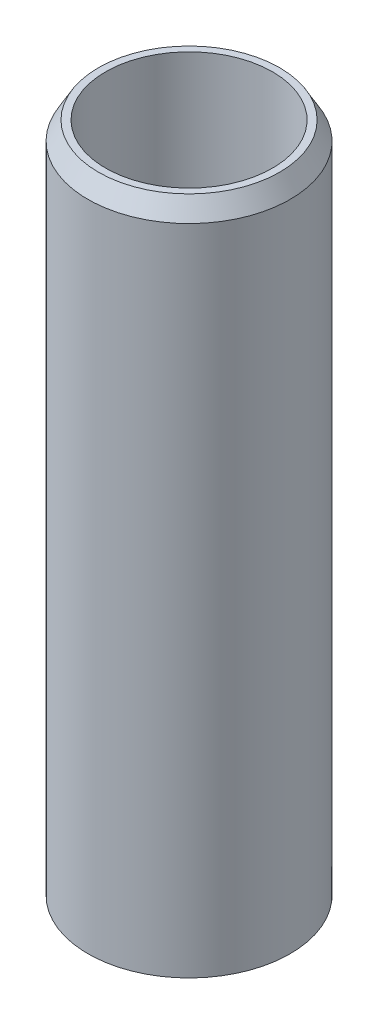
ISO-10303-21;
HEADER;
FILE_DESCRIPTION(('STEP AP214'),'2;1');
FILE_NAME('part.step','',(''),(''),'','','');
FILE_SCHEMA(('AUTOMOTIVE_DESIGN { 1 0 10303 214 1 1 1 1 }'));
ENDSEC;
DATA;
#1=APPLICATION_CONTEXT('core data for automotive mechanical design processes');
#2=APPLICATION_PROTOCOL_DEFINITION('international standard','automotive_design',2000,#1);
#3=PRODUCT_CONTEXT('',#1,'mechanical');
#4=PRODUCT('Part','Part','',(#3));
#5=PRODUCT_RELATED_PRODUCT_CATEGORY('part','',(#4));
#6=PRODUCT_DEFINITION_FORMATION('','',#4);
#7=PRODUCT_DEFINITION_CONTEXT('part definition',#1,'design');
#8=PRODUCT_DEFINITION('design','',#6,#7);
#9=PRODUCT_DEFINITION_SHAPE('','',#8);
#10=(LENGTH_UNIT() NAMED_UNIT(*) SI_UNIT(.MILLI.,.METRE.));
#11=(NAMED_UNIT(*) PLANE_ANGLE_UNIT() SI_UNIT($,.RADIAN.));
#12=(NAMED_UNIT(*) SI_UNIT($,.STERADIAN.) SOLID_ANGLE_UNIT());
#13=UNCERTAINTY_MEASURE_WITH_UNIT(LENGTH_MEASURE(1.E-05),#10,'distance_accuracy_value','');
#14=(GEOMETRIC_REPRESENTATION_CONTEXT(3) GLOBAL_UNCERTAINTY_ASSIGNED_CONTEXT((#13)) GLOBAL_UNIT_ASSIGNED_CONTEXT((#10,
#11,#12)) REPRESENTATION_CONTEXT('',''));
#15=CARTESIAN_POINT('',(0.,0.,0.));
#16=DIRECTION('',(0.,0.,1.));
#17=DIRECTION('',(1.,0.,0.));
#18=AXIS2_PLACEMENT_3D('',#15,#16,#17);
#19=CARTESIAN_POINT('',(0.,219.233663231035,0.));
#20=DIRECTION('',(0.,-1.,0.));
#21=DIRECTION('',(0.,0.,-1.));
#22=AXIS2_PLACEMENT_3D('',#19,#20,#21);
#23=CYLINDRICAL_SURFACE('',#22,32.5);
#24=CARTESIAN_POINT('',(0.,213.366465257886,0.));
#25=DIRECTION('',(0.,1.,0.));
#26=DIRECTION('',(0.,0.,1.));
#27=AXIS2_PLACEMENT_3D('',#24,#25,#26);
#28=CIRCLE('',#27,32.5);
#29=CARTESIAN_POINT('',(0.,213.366465257886,-32.5));
#30=VERTEX_POINT('',#29);
#31=EDGE_CURVE('E50',#30,#30,#28,.F.);
#32=CARTESIAN_POINT('',(0.,3.38742832918673,0.));
#33=DIRECTION('',(0.,1.,0.));
#34=DIRECTION('',(0.,0.,1.));
#35=AXIS2_PLACEMENT_3D('',#32,#33,#34);
#36=CIRCLE('',#35,32.5);
#37=CARTESIAN_POINT('',(0.,3.3874283291867,-32.5));
#38=VERTEX_POINT('',#37);
#39=EDGE_CURVE('E51',#38,#38,#36,.T.);
#40=CARTESIAN_POINT('',(0.,213.366465257886,-32.5));
#41=CARTESIAN_POINT('',(0.,211.179183623212,-32.5));
#42=CARTESIAN_POINT('',(0.,208.991901988538,-32.5));
#43=CARTESIAN_POINT('',(0.,204.61733871919,-32.5));
#44=CARTESIAN_POINT('',(0.,202.430057084516,-32.5));
#45=CARTESIAN_POINT('',(0.,198.055493815168,-32.5));
#46=CARTESIAN_POINT('',(0.,195.868212180494,-32.5));
#47=CARTESIAN_POINT('',(0.,191.493648911146,-32.5));
#48=CARTESIAN_POINT('',(0.,189.306367276472,-32.5));
#49=CARTESIAN_POINT('',(0.,184.931804007125,-32.5));
#50=CARTESIAN_POINT('',(0.,182.744522372451,-32.5));
#51=CARTESIAN_POINT('',(0.,178.369959103103,-32.5));
#52=CARTESIAN_POINT('',(0.,176.182677468429,-32.5));
#53=CARTESIAN_POINT('',(0.,171.808114199081,-32.5));
#54=CARTESIAN_POINT('',(0.,169.620832564407,-32.5));
#55=CARTESIAN_POINT('',(0.,165.246269295059,-32.5));
#56=CARTESIAN_POINT('',(0.,163.058987660385,-32.5));
#57=CARTESIAN_POINT('',(0.,158.684424391037,-32.5));
#58=CARTESIAN_POINT('',(0.,156.497142756363,-32.5));
#59=CARTESIAN_POINT('',(0.,152.122579487015,-32.5));
#60=CARTESIAN_POINT('',(0.,149.935297852341,-32.5));
#61=CARTESIAN_POINT('',(0.,145.560734582993,-32.5));
#62=CARTESIAN_POINT('',(0.,143.37345294832,-32.5));
#63=CARTESIAN_POINT('',(0.,138.998889678972,-32.5));
#64=CARTESIAN_POINT('',(0.,136.811608044298,-32.5));
#65=CARTESIAN_POINT('',(0.,132.43704477495,-32.5));
#66=CARTESIAN_POINT('',(0.,130.249763140276,-32.5));
#67=CARTESIAN_POINT('',(0.,125.875199870928,-32.5));
#68=CARTESIAN_POINT('',(0.,123.687918236254,-32.5));
#69=CARTESIAN_POINT('',(0.,119.313354966906,-32.5));
#70=CARTESIAN_POINT('',(0.,117.126073332232,-32.5));
#71=CARTESIAN_POINT('',(0.,112.751510062884,-32.5));
#72=CARTESIAN_POINT('',(0.,110.56422842821,-32.5));
#73=CARTESIAN_POINT('',(0.,106.189665158862,-32.5));
#74=CARTESIAN_POINT('',(0.,104.002383524188,-32.5));
#75=CARTESIAN_POINT('',(0.,99.6278202548405,-32.5));
#76=CARTESIAN_POINT('',(0.,97.4405386201666,-32.5));
#77=CARTESIAN_POINT('',(0.,93.0659753508187,-32.5));
#78=CARTESIAN_POINT('',(0.,90.8786937161447,-32.5));
#79=CARTESIAN_POINT('',(0.,86.5041304467968,-32.5));
#80=CARTESIAN_POINT('',(0.,84.3168488121229,-32.5));
#81=CARTESIAN_POINT('',(0.,79.942285542775,-32.5));
#82=CARTESIAN_POINT('',(0.,77.755003908101,-32.5));
#83=CARTESIAN_POINT('',(0.,73.3804406387531,-32.5));
#84=CARTESIAN_POINT('',(0.,71.1931590040792,-32.5));
#85=CARTESIAN_POINT('',(0.,66.8185957347313,-32.5));
#86=CARTESIAN_POINT('',(0.,64.6313141000573,-32.5));
#87=CARTESIAN_POINT('',(0.,60.2567508307094,-32.5));
#88=CARTESIAN_POINT('',(0.,58.0694691960355,-32.5));
#89=CARTESIAN_POINT('',(0.,53.6949059266876,-32.5));
#90=CARTESIAN_POINT('',(0.,51.5076242920136,-32.5));
#91=CARTESIAN_POINT('',(0.,47.1330610226657,-32.5));
#92=CARTESIAN_POINT('',(0.,44.9457793879918,-32.5));
#93=CARTESIAN_POINT('',(0.,40.5712161186439,-32.5));
#94=CARTESIAN_POINT('',(0.,38.3839344839699,-32.5));
#95=CARTESIAN_POINT('',(0.,34.009371214622,-32.5));
#96=CARTESIAN_POINT('',(0.,31.8220895799481,-32.5));
#97=CARTESIAN_POINT('',(0.,27.4475263106002,-32.5));
#98=CARTESIAN_POINT('',(0.,25.2602446759262,-32.5));
#99=CARTESIAN_POINT('',(0.,20.8856814065783,-32.5));
#100=CARTESIAN_POINT('',(0.,18.6983997719044,-32.5));
#101=CARTESIAN_POINT('',(0.,14.3238365025565,-32.5));
#102=CARTESIAN_POINT('',(0.,12.1365548678825,-32.5));
#103=CARTESIAN_POINT('',(0.,7.7619915985346,-32.5));
#104=CARTESIAN_POINT('',(0.,5.57470996386065,-32.5));
#105=CARTESIAN_POINT('',(0.,3.3874283291867,-32.5));
#106=B_SPLINE_CURVE_WITH_KNOTS('',3,(#40,#41,#42,#43,#44,#45,#46,#47,#48,#49,#50,#51,#52,#53,
#54,#55,#56,#57,#58,#59,#60,#61,#62,#63,#64,#65,#66,#67,#68,#69,#70,#71,#72,#73,#74,#75,#76,#77,
#78,#79,#80,#81,#82,#83,#84,#85,#86,#87,#88,#89,#90,#91,#92,#93,#94,#95,#96,#97,#98,#99,#100,
#101,#102,#103,#104,#105),.UNSPECIFIED.,.F.,.F.,(4,2,2,2,2,2,2,2,2,2,2,2,2,2,2,2,2,2,2,2,2,2,2,
2,2,2,2,2,2,2,2,2,4),(0.,6.56184490402184,13.1236898080437,19.6855347120656,26.2473796160874,
32.8092245201092,39.3710694241311,45.9329143281529,52.4947592321748,59.0566041361966,
65.6184490402185,72.1802939442403,78.7421388482622,85.303983752284,91.8658286563059,
98.4276735603277,104.98951846435,111.551363368371,118.113208272393,124.675053176415,
131.236898080437,137.798742984459,144.360587888481,150.922432792503,157.484277696524,
164.046122600546,170.607967504568,177.16981240859,183.731657312612,190.293502216634,
196.855347120655,203.417192024677,209.979036928699),.UNSPECIFIED.);
#107=EDGE_CURVE('BSEAM39',#30,#38,#106,.T.);
#108=ORIENTED_EDGE('',*,*,#31,.T.);
#109=ORIENTED_EDGE('',*,*,#39,.T.);
#110=ORIENTED_EDGE('',*,*,#107,.T.);
#111=ORIENTED_EDGE('',*,*,#107,.F.);
#112=EDGE_LOOP('',(#108,#110,#109,#111));
#113=FACE_BOUND('',#112,.T.);
#114=ADVANCED_FACE('F39',(#113),#23,.T.);
#115=CARTESIAN_POINT('',(0.,219.233663231035,0.));
#116=DIRECTION('',(0.,1.,0.));
#117=DIRECTION('',(0.,0.,1.));
#118=AXIS2_PLACEMENT_3D('',#115,#116,#117);
#119=PLANE('',#118);
#120=CARTESIAN_POINT('',(0.,219.233663231035,0.));
#121=DIRECTION('',(0.,1.,0.));
#122=DIRECTION('',(0.,0.,1.));
#123=AXIS2_PLACEMENT_3D('',#120,#121,#122);
#124=CIRCLE('',#123,29.1125716708135);
#125=CARTESIAN_POINT('',(0.,219.233663231035,29.1125716708135));
#126=VERTEX_POINT('',#125);
#127=EDGE_CURVE('E54',#126,#126,#124,.T.);
#128=ORIENTED_EDGE('',*,*,#127,.T.);
#129=EDGE_LOOP('',(#128));
#130=FACE_BOUND('',#129,.T.);
#131=CARTESIAN_POINT('',(0.,219.233663231035,0.));
#132=DIRECTION('',(0.,1.,0.));
#133=DIRECTION('',(0.,0.,1.));
#134=AXIS2_PLACEMENT_3D('',#131,#132,#133);
#135=CIRCLE('',#134,26.83285382735);
#136=CARTESIAN_POINT('',(0.,219.233663231035,-26.83285382735));
#137=VERTEX_POINT('',#136);
#138=EDGE_CURVE('E58',#137,#137,#135,.T.);
#139=ORIENTED_EDGE('',*,*,#138,.F.);
#140=EDGE_LOOP('',(#139));
#141=FACE_BOUND('',#140,.T.);
#142=ADVANCED_FACE('F68',(#130,#141),#119,.T.);
#143=CARTESIAN_POINT('',(0.,219.233663231035,0.));
#144=DIRECTION('',(0.,-1.,0.));
#145=DIRECTION('',(0.,0.,-1.));
#146=AXIS2_PLACEMENT_3D('',#143,#144,#145);
#147=CYLINDRICAL_SURFACE('',#146,26.83285382735);
#148=CARTESIAN_POINT('',(0.,0.115499960870229,0.));
#149=DIRECTION('',(0.,1.,0.));
#150=DIRECTION('',(0.,0.,1.));
#151=AXIS2_PLACEMENT_3D('',#148,#149,#150);
#152=CIRCLE('',#151,26.83285382735);
#153=CARTESIAN_POINT('',(0.,0.115499960870236,-26.83285382735));
#154=VERTEX_POINT('',#153);
#155=EDGE_CURVE('E10',#154,#154,#152,.F.);
#156=CARTESIAN_POINT('',(0.,0.115499960870236,-26.83285382735));
#157=CARTESIAN_POINT('',(0.,2.39798082826779,-26.83285382735));
#158=CARTESIAN_POINT('',(0.,4.68046169566535,-26.83285382735));
#159=CARTESIAN_POINT('',(0.,9.24542343046045,-26.83285382735));
#160=CARTESIAN_POINT('',(0.,11.527904297858,-26.83285382735));
#161=CARTESIAN_POINT('',(0.,16.0928660326531,-26.83285382735));
#162=CARTESIAN_POINT('',(0.,18.3753469000506,-26.83285382735));
#163=CARTESIAN_POINT('',(0.,22.9403086348458,-26.83285382735));
#164=CARTESIAN_POINT('',(0.,25.2227895022433,-26.83285382735));
#165=CARTESIAN_POINT('',(0.,29.7877512370384,-26.83285382735));
#166=CARTESIAN_POINT('',(0.,32.070232104436,-26.83285382735));
#167=CARTESIAN_POINT('',(0.,36.6351938392311,-26.83285382735));
#168=CARTESIAN_POINT('',(0.,38.9176747066286,-26.83285382735));
#169=CARTESIAN_POINT('',(0.,43.4826364414237,-26.83285382735));
#170=CARTESIAN_POINT('',(0.,45.7651173088213,-26.83285382735));
#171=CARTESIAN_POINT('',(0.,50.3300790436164,-26.83285382735));
#172=CARTESIAN_POINT('',(0.,52.6125599110139,-26.83285382735));
#173=CARTESIAN_POINT('',(0.,57.177521645809,-26.83285382735));
#174=CARTESIAN_POINT('',(0.,59.4600025132066,-26.83285382735));
#175=CARTESIAN_POINT('',(0.,64.0249642480017,-26.83285382735));
#176=CARTESIAN_POINT('',(0.,66.3074451153992,-26.83285382735));
#177=CARTESIAN_POINT('',(0.,70.8724068501943,-26.83285382735));
#178=CARTESIAN_POINT('',(0.,73.1548877175919,-26.83285382735));
#179=CARTESIAN_POINT('',(0.,77.719849452387,-26.83285382735));
#180=CARTESIAN_POINT('',(0.,80.0023303197846,-26.83285382735));
#181=CARTESIAN_POINT('',(0.,84.5672920545797,-26.83285382735));
#182=CARTESIAN_POINT('',(0.,86.8497729219772,-26.83285382735));
#183=CARTESIAN_POINT('',(0.,91.4147346567723,-26.83285382735));
#184=CARTESIAN_POINT('',(0.,93.6972155241699,-26.83285382735));
#185=CARTESIAN_POINT('',(0.,98.262177258965,-26.83285382735));
#186=CARTESIAN_POINT('',(0.,100.544658126363,-26.83285382735));
#187=CARTESIAN_POINT('',(0.,105.109619861158,-26.83285382735));
#188=CARTESIAN_POINT('',(0.,107.392100728555,-26.83285382735));
#189=CARTESIAN_POINT('',(0.,111.95706246335,-26.83285382735));
#190=CARTESIAN_POINT('',(0.,114.239543330748,-26.83285382735));
#191=CARTESIAN_POINT('',(0.,118.804505065543,-26.83285382735));
#192=CARTESIAN_POINT('',(0.,121.08698593294,-26.83285382735));
#193=CARTESIAN_POINT('',(0.,125.651947667736,-26.83285382735));
#194=CARTESIAN_POINT('',(0.,127.934428535133,-26.83285382735));
#195=CARTESIAN_POINT('',(0.,132.499390269928,-26.83285382735));
#196=CARTESIAN_POINT('',(0.,134.781871137326,-26.83285382735));
#197=CARTESIAN_POINT('',(0.,139.346832872121,-26.83285382735));
#198=CARTESIAN_POINT('',(0.,141.629313739518,-26.83285382735));
#199=CARTESIAN_POINT('',(0.,146.194275474314,-26.83285382735));
#200=CARTESIAN_POINT('',(0.,148.476756341711,-26.83285382735));
#201=CARTESIAN_POINT('',(0.,153.041718076506,-26.83285382735));
#202=CARTESIAN_POINT('',(0.,155.324198943904,-26.83285382735));
#203=CARTESIAN_POINT('',(0.,159.889160678699,-26.83285382735));
#204=CARTESIAN_POINT('',(0.,162.171641546096,-26.83285382735));
#205=CARTESIAN_POINT('',(0.,166.736603280892,-26.83285382735));
#206=CARTESIAN_POINT('',(0.,169.019084148289,-26.83285382735));
#207=CARTESIAN_POINT('',(0.,173.584045883084,-26.83285382735));
#208=CARTESIAN_POINT('',(0.,175.866526750482,-26.83285382735));
#209=CARTESIAN_POINT('',(0.,180.431488485277,-26.83285382735));
#210=CARTESIAN_POINT('',(0.,182.713969352674,-26.83285382735));
#211=CARTESIAN_POINT('',(0.,187.278931087469,-26.83285382735));
#212=CARTESIAN_POINT('',(0.,189.561411954867,-26.83285382735));
#213=CARTESIAN_POINT('',(0.,194.126373689662,-26.83285382735));
#214=CARTESIAN_POINT('',(0.,196.40885455706,-26.83285382735));
#215=CARTESIAN_POINT('',(0.,200.973816291855,-26.83285382735));
#216=CARTESIAN_POINT('',(0.,203.256297159252,-26.83285382735));
#217=CARTESIAN_POINT('',(0.,207.821258894047,-26.83285382735));
#218=CARTESIAN_POINT('',(0.,210.103739761445,-26.83285382735));
#219=CARTESIAN_POINT('',(0.,214.66870149624,-26.83285382735));
#220=CARTESIAN_POINT('',(0.,216.951182363638,-26.83285382735));
#221=CARTESIAN_POINT('',(0.,219.233663231035,-26.83285382735));
#222=B_SPLINE_CURVE_WITH_KNOTS('',3,(#156,#157,#158,#159,#160,#161,#162,#163,#164,#165,#166,
#167,#168,#169,#170,#171,#172,#173,#174,#175,#176,#177,#178,#179,#180,#181,#182,#183,#184,#185,
#186,#187,#188,#189,#190,#191,#192,#193,#194,#195,#196,#197,#198,#199,#200,#201,#202,#203,#204,
#205,#206,#207,#208,#209,#210,#211,#212,#213,#214,#215,#216,#217,#218,#219,#220,#221),
.UNSPECIFIED.,.F.,.F.,(4,2,2,2,2,2,2,2,2,2,2,2,2,2,2,2,2,2,2,2,2,2,2,2,2,2,2,2,2,2,2,2,4),(0.,
6.84744260219267,13.6948852043853,20.542327806578,27.3897704087706,34.2372130109633,
41.0846556131559,47.9320982153486,54.7795408175412,61.6269834197339,68.4744260219265,
75.3218686241192,82.1693112263119,89.0167538285045,95.8641964306972,102.71163903289,
109.559081635082,116.406524237275,123.253966839468,130.10140944166,136.948852043853,
143.796294646046,150.643737248238,157.491179850431,164.338622452624,171.186065054816,
178.033507657009,184.880950259202,191.728392861394,198.575835463587,205.42327806578,
212.270720667972,219.118163270165),.UNSPECIFIED.);
#223=EDGE_CURVE('BSEAM62',#154,#137,#222,.T.);
#224=ORIENTED_EDGE('',*,*,#155,.T.);
#225=ORIENTED_EDGE('',*,*,#138,.T.);
#226=ORIENTED_EDGE('',*,*,#223,.T.);
#227=ORIENTED_EDGE('',*,*,#223,.F.);
#228=EDGE_LOOP('',(#224,#226,#225,#227));
#229=FACE_BOUND('',#228,.T.);
#230=ADVANCED_FACE('F62',(#229),#147,.F.);
#231=CARTESIAN_POINT('',(0.,219.233663231035,0.));
#232=DIRECTION('',(0.,-1.,0.));
#233=DIRECTION('',(0.,0.,-1.));
#234=AXIS2_PLACEMENT_3D('',#231,#232,#233);
#235=CONICAL_SURFACE('',#234,29.1125716708135,0.523598775598295);
#236=ORIENTED_EDGE('',*,*,#31,.F.);
#237=EDGE_LOOP('',(#236));
#238=FACE_BOUND('',#237,.T.);
#239=ORIENTED_EDGE('',*,*,#127,.F.);
#240=EDGE_LOOP('',(#239));
#241=FACE_BOUND('',#240,.T.);
#242=ADVANCED_FACE('F74',(#238,#241),#235,.T.);
#243=CARTESIAN_POINT('',(0.,3.38742832918673,0.));
#244=DIRECTION('',(0.,1.,0.));
#245=DIRECTION('',(0.,0.,1.));
#246=AXIS2_PLACEMENT_3D('',#243,#244,#245);
#247=CONICAL_SURFACE('',#246,32.5,1.04719755119659);
#248=ORIENTED_EDGE('',*,*,#155,.F.);
#249=EDGE_LOOP('',(#248));
#250=FACE_BOUND('',#249,.T.);
#251=ORIENTED_EDGE('',*,*,#39,.F.);
#252=EDGE_LOOP('',(#251));
#253=FACE_BOUND('',#252,.T.);
#254=ADVANCED_FACE('F45',(#250,#253),#247,.T.);
#255=CLOSED_SHELL('',(#114,#142,#230,#242,#254));
#256=MANIFOLD_SOLID_BREP('B2',#255);
#257=ADVANCED_BREP_SHAPE_REPRESENTATION('',(#18,#256),#14);
#258=SHAPE_DEFINITION_REPRESENTATION(#9,#257);
ENDSEC;
END-ISO-10303-21;
